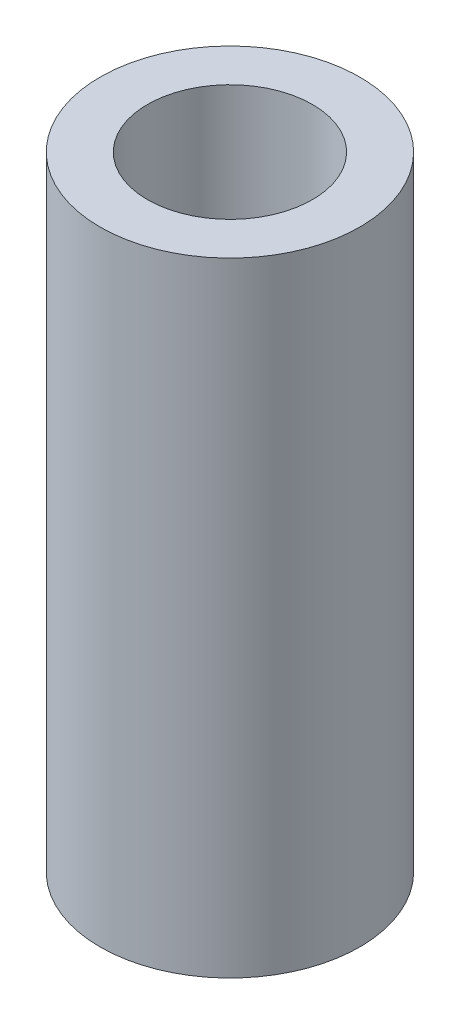
ISO-10303-21;
HEADER;
FILE_DESCRIPTION(('STEP AP214'),'2;1');
FILE_NAME('part.step','',(''),(''),'','','');
FILE_SCHEMA(('AUTOMOTIVE_DESIGN { 1 0 10303 214 1 1 1 1 }'));
ENDSEC;
DATA;
#1=APPLICATION_CONTEXT('core data for automotive mechanical design processes');
#2=APPLICATION_PROTOCOL_DEFINITION('international standard','automotive_design',2000,#1);
#3=PRODUCT_CONTEXT('',#1,'mechanical');
#4=PRODUCT('Part','Part','',(#3));
#5=PRODUCT_RELATED_PRODUCT_CATEGORY('part','',(#4));
#6=PRODUCT_DEFINITION_FORMATION('','',#4);
#7=PRODUCT_DEFINITION_CONTEXT('part definition',#1,'design');
#8=PRODUCT_DEFINITION('design','',#6,#7);
#9=PRODUCT_DEFINITION_SHAPE('','',#8);
#10=(LENGTH_UNIT() NAMED_UNIT(*) SI_UNIT(.MILLI.,.METRE.));
#11=(NAMED_UNIT(*) PLANE_ANGLE_UNIT() SI_UNIT($,.RADIAN.));
#12=(NAMED_UNIT(*) SI_UNIT($,.STERADIAN.) SOLID_ANGLE_UNIT());
#13=UNCERTAINTY_MEASURE_WITH_UNIT(LENGTH_MEASURE(1.E-05),#10,'distance_accuracy_value','');
#14=(GEOMETRIC_REPRESENTATION_CONTEXT(3) GLOBAL_UNCERTAINTY_ASSIGNED_CONTEXT((#13)) GLOBAL_UNIT_ASSIGNED_CONTEXT((#10,
#11,#12)) REPRESENTATION_CONTEXT('',''));
#15=CARTESIAN_POINT('',(0.,0.,0.));
#16=DIRECTION('',(0.,0.,1.));
#17=DIRECTION('',(1.,0.,0.));
#18=AXIS2_PLACEMENT_3D('',#15,#16,#17);
#19=CARTESIAN_POINT('',(0.,19.05,0.));
#20=DIRECTION('',(0.,-1.,0.));
#21=DIRECTION('',(0.,0.,-1.));
#22=AXIS2_PLACEMENT_3D('',#19,#20,#21);
#23=CYLINDRICAL_SURFACE('',#22,3.96875);
#24=CARTESIAN_POINT('',(0.,19.05,0.));
#25=DIRECTION('',(0.,1.,0.));
#26=DIRECTION('',(0.,0.,1.));
#27=AXIS2_PLACEMENT_3D('',#24,#25,#26);
#28=CIRCLE('',#27,3.96875);
#29=CARTESIAN_POINT('',(0.,19.05,3.96875));
#30=VERTEX_POINT('',#29);
#31=EDGE_CURVE('E10',#30,#30,#28,.T.);
#32=ORIENTED_EDGE('',*,*,#31,.F.);
#33=EDGE_LOOP('',(#32));
#34=FACE_BOUND('',#33,.T.);
#35=CARTESIAN_POINT('',(0.,0.,0.));
#36=DIRECTION('',(0.,1.,0.));
#37=DIRECTION('',(0.,0.,1.));
#38=AXIS2_PLACEMENT_3D('',#35,#36,#37);
#39=CIRCLE('',#38,3.96875);
#40=CARTESIAN_POINT('',(0.,0.,3.96875));
#41=VERTEX_POINT('',#40);
#42=EDGE_CURVE('E46',#41,#41,#39,.T.);
#43=ORIENTED_EDGE('',*,*,#42,.T.);
#44=EDGE_LOOP('',(#43));
#45=FACE_BOUND('',#44,.T.);
#46=ADVANCED_FACE('F43',(#34,#45),#23,.T.);
#47=CARTESIAN_POINT('',(0.,19.05,0.));
#48=DIRECTION('',(0.,1.,0.));
#49=DIRECTION('',(0.,0.,1.));
#50=AXIS2_PLACEMENT_3D('',#47,#48,#49);
#51=PLANE('',#50);
#52=CARTESIAN_POINT('',(0.,19.05,0.));
#53=DIRECTION('',(0.,1.,0.));
#54=DIRECTION('',(0.,0.,1.));
#55=AXIS2_PLACEMENT_3D('',#52,#53,#54);
#56=CIRCLE('',#55,2.52095);
#57=CARTESIAN_POINT('',(0.,19.05,2.52095));
#58=VERTEX_POINT('',#57);
#59=EDGE_CURVE('E55',#58,#58,#56,.T.);
#60=ORIENTED_EDGE('',*,*,#59,.F.);
#61=EDGE_LOOP('',(#60));
#62=FACE_BOUND('',#61,.T.);
#63=ORIENTED_EDGE('',*,*,#31,.T.);
#64=EDGE_LOOP('',(#63));
#65=FACE_BOUND('',#64,.T.);
#66=ADVANCED_FACE('F75',(#62,#65),#51,.T.);
#67=CARTESIAN_POINT('',(0.,0.,0.));
#68=DIRECTION('',(0.,1.,0.));
#69=DIRECTION('',(0.,0.,1.));
#70=AXIS2_PLACEMENT_3D('',#67,#68,#69);
#71=PLANE('',#70);
#72=CARTESIAN_POINT('',(0.,0.,0.));
#73=DIRECTION('',(0.,1.,0.));
#74=DIRECTION('',(0.,0.,1.));
#75=AXIS2_PLACEMENT_3D('',#72,#73,#74);
#76=CIRCLE('',#75,2.52095);
#77=CARTESIAN_POINT('',(0.,0.,2.52095));
#78=VERTEX_POINT('',#77);
#79=EDGE_CURVE('E60',#78,#78,#76,.T.);
#80=ORIENTED_EDGE('',*,*,#79,.T.);
#81=EDGE_LOOP('',(#80));
#82=FACE_BOUND('',#81,.T.);
#83=ORIENTED_EDGE('',*,*,#42,.F.);
#84=EDGE_LOOP('',(#83));
#85=FACE_BOUND('',#84,.T.);
#86=ADVANCED_FACE('F65',(#82,#85),#71,.F.);
#87=CARTESIAN_POINT('',(0.,0.,0.));
#88=DIRECTION('',(0.,1.,0.));
#89=DIRECTION('',(0.,0.,1.));
#90=AXIS2_PLACEMENT_3D('',#87,#88,#89);
#91=CYLINDRICAL_SURFACE('',#90,2.52095);
#92=ORIENTED_EDGE('',*,*,#59,.T.);
#93=EDGE_LOOP('',(#92));
#94=FACE_BOUND('',#93,.T.);
#95=ORIENTED_EDGE('',*,*,#79,.F.);
#96=EDGE_LOOP('',(#95));
#97=FACE_BOUND('',#96,.T.);
#98=ADVANCED_FACE('F68',(#94,#97),#91,.F.);
#99=CLOSED_SHELL('',(#46,#66,#86,#98));
#100=MANIFOLD_SOLID_BREP('B2',#99);
#101=ADVANCED_BREP_SHAPE_REPRESENTATION('',(#18,#100),#14);
#102=SHAPE_DEFINITION_REPRESENTATION(#9,#101);
ENDSEC;
END-ISO-10303-21;
